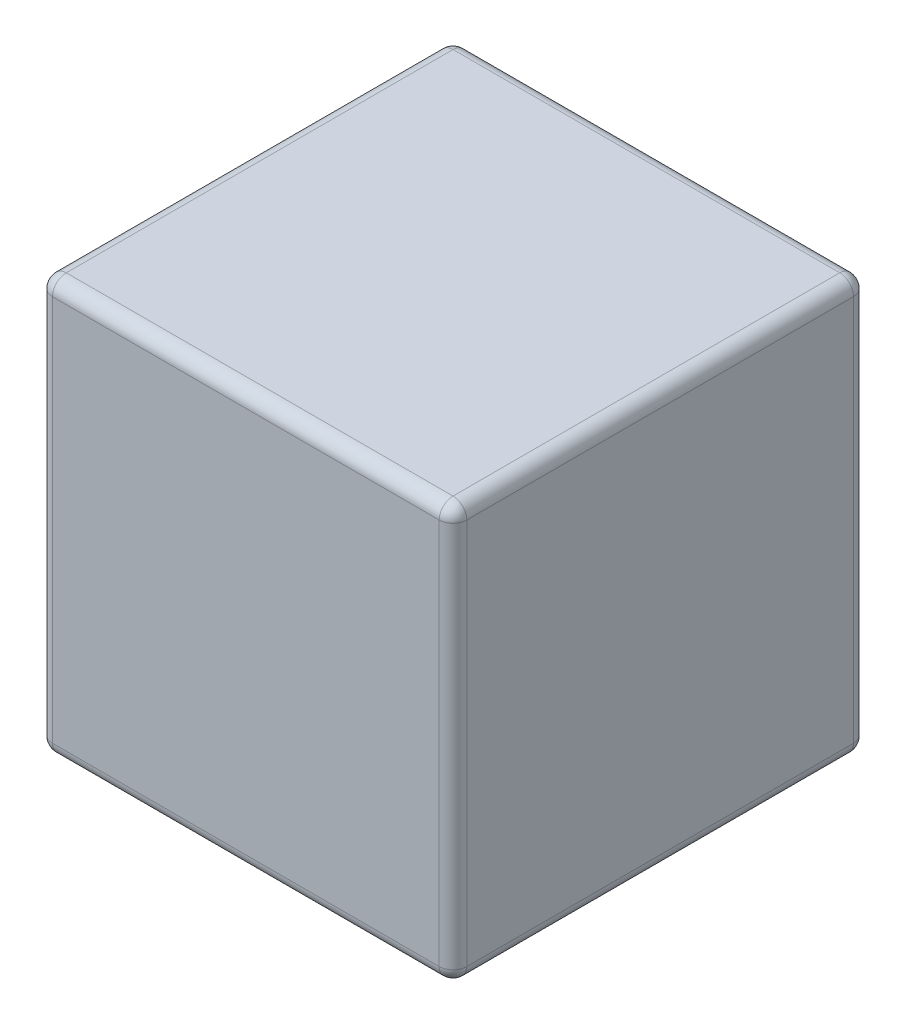
ISO-10303-21;
HEADER;
FILE_DESCRIPTION(('STEP AP214'),'2;1');
FILE_NAME('part.step','',(''),(''),'','','');
FILE_SCHEMA(('AUTOMOTIVE_DESIGN { 1 0 10303 214 1 1 1 1 }'));
ENDSEC;
DATA;
#1=APPLICATION_CONTEXT('core data for automotive mechanical design processes');
#2=APPLICATION_PROTOCOL_DEFINITION('international standard','automotive_design',2000,#1);
#3=PRODUCT_CONTEXT('',#1,'mechanical');
#4=PRODUCT('Part','Part','',(#3));
#5=PRODUCT_RELATED_PRODUCT_CATEGORY('part','',(#4));
#6=PRODUCT_DEFINITION_FORMATION('','',#4);
#7=PRODUCT_DEFINITION_CONTEXT('part definition',#1,'design');
#8=PRODUCT_DEFINITION('design','',#6,#7);
#9=PRODUCT_DEFINITION_SHAPE('','',#8);
#10=(LENGTH_UNIT() NAMED_UNIT(*) SI_UNIT(.MILLI.,.METRE.));
#11=(NAMED_UNIT(*) PLANE_ANGLE_UNIT() SI_UNIT($,.RADIAN.));
#12=(NAMED_UNIT(*) SI_UNIT($,.STERADIAN.) SOLID_ANGLE_UNIT());
#13=UNCERTAINTY_MEASURE_WITH_UNIT(LENGTH_MEASURE(1.E-05),#10,'distance_accuracy_value','');
#14=(GEOMETRIC_REPRESENTATION_CONTEXT(3) GLOBAL_UNCERTAINTY_ASSIGNED_CONTEXT((#13)) GLOBAL_UNIT_ASSIGNED_CONTEXT((#10,
#11,#12)) REPRESENTATION_CONTEXT('',''));
#15=CARTESIAN_POINT('',(0.,0.,0.));
#16=DIRECTION('',(0.,0.,1.));
#17=DIRECTION('',(1.,0.,0.));
#18=AXIS2_PLACEMENT_3D('',#15,#16,#17);
#19=CARTESIAN_POINT('',(1.5,0.,0.));
#20=DIRECTION('',(0.,1.,0.));
#21=DIRECTION('',(0.,0.,1.));
#22=AXIS2_PLACEMENT_3D('',#19,#20,#21);
#23=PLANE('',#22);
#24=DIRECTION('',(-1.,0.,0.));
#25=VECTOR('',#24,1.);
#26=CARTESIAN_POINT('',(1.5,0.,2.9));
#27=LINE('',#26,#25);
#28=CARTESIAN_POINT('',(1.4,0.,2.9));
#29=VERTEX_POINT('',#28);
#30=CARTESIAN_POINT('',(-1.4,0.,2.9));
#31=VERTEX_POINT('',#30);
#32=EDGE_CURVE('E138',#29,#31,#27,.T.);
#33=ORIENTED_EDGE('',*,*,#32,.T.);
#34=DIRECTION('',(0.,0.,-1.));
#35=VECTOR('',#34,1.);
#36=CARTESIAN_POINT('',(-1.4,0.,0.));
#37=LINE('',#36,#35);
#38=CARTESIAN_POINT('',(-1.4,0.,0.1));
#39=VERTEX_POINT('',#38);
#40=EDGE_CURVE('E134',#31,#39,#37,.T.);
#41=ORIENTED_EDGE('',*,*,#40,.T.);
#42=DIRECTION('',(-1.,0.,0.));
#43=VECTOR('',#42,1.);
#44=CARTESIAN_POINT('',(1.5,0.,0.1));
#45=LINE('',#44,#43);
#46=CARTESIAN_POINT('',(1.4,0.,0.1));
#47=VERTEX_POINT('',#46);
#48=EDGE_CURVE('E129',#39,#47,#45,.F.);
#49=ORIENTED_EDGE('',*,*,#48,.T.);
#50=DIRECTION('',(0.,0.,-1.));
#51=VECTOR('',#50,1.);
#52=CARTESIAN_POINT('',(1.4,0.,0.));
#53=LINE('',#52,#51);
#54=EDGE_CURVE('E131',#47,#29,#53,.F.);
#55=ORIENTED_EDGE('',*,*,#54,.T.);
#56=EDGE_LOOP('',(#33,#41,#49,#55));
#57=FACE_BOUND('',#56,.T.);
#58=ADVANCED_FACE('F41',(#57),#23,.F.);
#59=CARTESIAN_POINT('',(1.5,0.,0.));
#60=DIRECTION('',(0.,0.,1.));
#61=DIRECTION('',(1.,0.,0.));
#62=AXIS2_PLACEMENT_3D('',#59,#60,#61);
#63=PLANE('',#62);
#64=DIRECTION('',(0.,1.,0.));
#65=VECTOR('',#64,1.);
#66=CARTESIAN_POINT('',(1.4,0.,0.));
#67=LINE('',#66,#65);
#68=CARTESIAN_POINT('',(1.4,2.9,0.));
#69=VERTEX_POINT('',#68);
#70=CARTESIAN_POINT('',(1.4,0.1,0.));
#71=VERTEX_POINT('',#70);
#72=EDGE_CURVE('E284',#69,#71,#67,.F.);
#73=ORIENTED_EDGE('',*,*,#72,.T.);
#74=DIRECTION('',(-1.,0.,0.));
#75=VECTOR('',#74,1.);
#76=CARTESIAN_POINT('',(1.5,0.1,0.));
#77=LINE('',#76,#75);
#78=CARTESIAN_POINT('',(-1.4,0.1,0.));
#79=VERTEX_POINT('',#78);
#80=EDGE_CURVE('E160',#71,#79,#77,.T.);
#81=ORIENTED_EDGE('',*,*,#80,.T.);
#82=DIRECTION('',(0.,1.,0.));
#83=VECTOR('',#82,1.);
#84=CARTESIAN_POINT('',(-1.4,3.,0.));
#85=LINE('',#84,#83);
#86=CARTESIAN_POINT('',(-1.4,2.9,0.));
#87=VERTEX_POINT('',#86);
#88=EDGE_CURVE('E226',#79,#87,#85,.T.);
#89=ORIENTED_EDGE('',*,*,#88,.T.);
#90=DIRECTION('',(-1.,0.,0.));
#91=VECTOR('',#90,1.);
#92=CARTESIAN_POINT('',(1.5,2.9,0.));
#93=LINE('',#92,#91);
#94=EDGE_CURVE('E282',#87,#69,#93,.F.);
#95=ORIENTED_EDGE('',*,*,#94,.T.);
#96=EDGE_LOOP('',(#73,#81,#89,#95));
#97=FACE_BOUND('',#96,.T.);
#98=ADVANCED_FACE('F291',(#97),#63,.F.);
#99=CARTESIAN_POINT('',(1.5,3.,0.));
#100=DIRECTION('',(0.,-1.,0.));
#101=DIRECTION('',(0.,0.,-1.));
#102=AXIS2_PLACEMENT_3D('',#99,#100,#101);
#103=PLANE('',#102);
#104=DIRECTION('',(0.,0.,1.));
#105=VECTOR('',#104,1.);
#106=CARTESIAN_POINT('',(1.4,3.,0.));
#107=LINE('',#106,#105);
#108=CARTESIAN_POINT('',(1.4,3.,2.9));
#109=VERTEX_POINT('',#108);
#110=CARTESIAN_POINT('',(1.4,3.,0.1));
#111=VERTEX_POINT('',#110);
#112=EDGE_CURVE('E50',#109,#111,#107,.F.);
#113=ORIENTED_EDGE('',*,*,#112,.T.);
#114=DIRECTION('',(-1.,0.,0.));
#115=VECTOR('',#114,1.);
#116=CARTESIAN_POINT('',(1.5,3.,0.1));
#117=LINE('',#116,#115);
#118=CARTESIAN_POINT('',(-1.4,3.,0.1));
#119=VERTEX_POINT('',#118);
#120=EDGE_CURVE('E11',#111,#119,#117,.T.);
#121=ORIENTED_EDGE('',*,*,#120,.T.);
#122=DIRECTION('',(0.,0.,1.));
#123=VECTOR('',#122,1.);
#124=CARTESIAN_POINT('',(-1.4,3.,3.));
#125=LINE('',#124,#123);
#126=CARTESIAN_POINT('',(-1.4,3.,2.9));
#127=VERTEX_POINT('',#126);
#128=EDGE_CURVE('E243',#119,#127,#125,.T.);
#129=ORIENTED_EDGE('',*,*,#128,.T.);
#130=DIRECTION('',(-1.,0.,0.));
#131=VECTOR('',#130,1.);
#132=CARTESIAN_POINT('',(1.5,3.,2.9));
#133=LINE('',#132,#131);
#134=EDGE_CURVE('E61',#127,#109,#133,.F.);
#135=ORIENTED_EDGE('',*,*,#134,.T.);
#136=EDGE_LOOP('',(#113,#121,#129,#135));
#137=FACE_BOUND('',#136,.T.);
#138=ADVANCED_FACE('F323',(#137),#103,.F.);
#139=CARTESIAN_POINT('',(1.5,0.,3.));
#140=DIRECTION('',(0.,0.,-1.));
#141=DIRECTION('',(-1.,0.,0.));
#142=AXIS2_PLACEMENT_3D('',#139,#140,#141);
#143=PLANE('',#142);
#144=DIRECTION('',(0.,-1.,0.));
#145=VECTOR('',#144,1.);
#146=CARTESIAN_POINT('',(-1.4,0.,3.));
#147=LINE('',#146,#145);
#148=CARTESIAN_POINT('',(-1.4,2.9,3.));
#149=VERTEX_POINT('',#148);
#150=CARTESIAN_POINT('',(-1.4,0.0999999999999992,3.));
#151=VERTEX_POINT('',#150);
#152=EDGE_CURVE('E224',#149,#151,#147,.T.);
#153=ORIENTED_EDGE('',*,*,#152,.T.);
#154=DIRECTION('',(-1.,0.,0.));
#155=VECTOR('',#154,1.);
#156=CARTESIAN_POINT('',(1.5,0.0999999999999992,3.));
#157=LINE('',#156,#155);
#158=CARTESIAN_POINT('',(1.4,0.0999999999999992,3.));
#159=VERTEX_POINT('',#158);
#160=EDGE_CURVE('E231',#151,#159,#157,.F.);
#161=ORIENTED_EDGE('',*,*,#160,.T.);
#162=DIRECTION('',(0.,-1.,0.));
#163=VECTOR('',#162,1.);
#164=CARTESIAN_POINT('',(1.4,0.,3.));
#165=LINE('',#164,#163);
#166=CARTESIAN_POINT('',(1.4,2.9,3.));
#167=VERTEX_POINT('',#166);
#168=EDGE_CURVE('E222',#159,#167,#165,.F.);
#169=ORIENTED_EDGE('',*,*,#168,.T.);
#170=DIRECTION('',(-1.,0.,0.));
#171=VECTOR('',#170,1.);
#172=CARTESIAN_POINT('',(1.5,2.9,3.));
#173=LINE('',#172,#171);
#174=EDGE_CURVE('E219',#167,#149,#173,.T.);
#175=ORIENTED_EDGE('',*,*,#174,.T.);
#176=EDGE_LOOP('',(#153,#161,#169,#175));
#177=FACE_BOUND('',#176,.T.);
#178=ADVANCED_FACE('F313',(#177),#143,.F.);
#179=CARTESIAN_POINT('',(1.5,0.,0.));
#180=DIRECTION('',(-1.,0.,0.));
#181=DIRECTION('',(0.,0.,1.));
#182=AXIS2_PLACEMENT_3D('',#179,#180,#181);
#183=PLANE('',#182);
#184=DIRECTION('',(0.,-1.,0.));
#185=VECTOR('',#184,1.);
#186=CARTESIAN_POINT('',(1.5,0.,2.9));
#187=LINE('',#186,#185);
#188=CARTESIAN_POINT('',(1.5,2.9,2.9));
#189=VERTEX_POINT('',#188);
#190=CARTESIAN_POINT('',(1.5,0.0999999999999992,2.9));
#191=VERTEX_POINT('',#190);
#192=EDGE_CURVE('E238',#189,#191,#187,.T.);
#193=ORIENTED_EDGE('',*,*,#192,.T.);
#194=DIRECTION('',(0.,0.,-1.));
#195=VECTOR('',#194,1.);
#196=CARTESIAN_POINT('',(1.5,0.1,0.));
#197=LINE('',#196,#195);
#198=CARTESIAN_POINT('',(1.5,0.1,0.1));
#199=VERTEX_POINT('',#198);
#200=EDGE_CURVE('E241',#191,#199,#197,.T.);
#201=ORIENTED_EDGE('',*,*,#200,.T.);
#202=DIRECTION('',(0.,1.,0.));
#203=VECTOR('',#202,1.);
#204=CARTESIAN_POINT('',(1.5,0.,0.1));
#205=LINE('',#204,#203);
#206=CARTESIAN_POINT('',(1.5,2.9,0.1));
#207=VERTEX_POINT('',#206);
#208=EDGE_CURVE('E236',#199,#207,#205,.T.);
#209=ORIENTED_EDGE('',*,*,#208,.T.);
#210=DIRECTION('',(0.,0.,1.));
#211=VECTOR('',#210,1.);
#212=CARTESIAN_POINT('',(1.5,2.9,0.));
#213=LINE('',#212,#211);
#214=EDGE_CURVE('E234',#207,#189,#213,.T.);
#215=ORIENTED_EDGE('',*,*,#214,.T.);
#216=EDGE_LOOP('',(#193,#201,#209,#215));
#217=FACE_BOUND('',#216,.T.);
#218=ADVANCED_FACE('F319',(#217),#183,.F.);
#219=CARTESIAN_POINT('',(-1.5,0.,0.));
#220=DIRECTION('',(-1.,0.,0.));
#221=DIRECTION('',(0.,0.,1.));
#222=AXIS2_PLACEMENT_3D('',#219,#220,#221);
#223=PLANE('',#222);
#224=DIRECTION('',(0.,1.,0.));
#225=VECTOR('',#224,1.);
#226=CARTESIAN_POINT('',(-1.5,0.,0.1));
#227=LINE('',#226,#225);
#228=CARTESIAN_POINT('',(-1.5,2.9,0.1));
#229=VERTEX_POINT('',#228);
#230=CARTESIAN_POINT('',(-1.5,0.1,0.1));
#231=VERTEX_POINT('',#230);
#232=EDGE_CURVE('E272',#229,#231,#227,.F.);
#233=ORIENTED_EDGE('',*,*,#232,.T.);
#234=DIRECTION('',(0.,0.,-1.));
#235=VECTOR('',#234,1.);
#236=CARTESIAN_POINT('',(-1.5,0.0999999999999991,3.));
#237=LINE('',#236,#235);
#238=CARTESIAN_POINT('',(-1.5,0.0999999999999992,2.9));
#239=VERTEX_POINT('',#238);
#240=EDGE_CURVE('E276',#231,#239,#237,.F.);
#241=ORIENTED_EDGE('',*,*,#240,.T.);
#242=DIRECTION('',(0.,-1.,0.));
#243=VECTOR('',#242,1.);
#244=CARTESIAN_POINT('',(-1.5,3.,2.9));
#245=LINE('',#244,#243);
#246=CARTESIAN_POINT('',(-1.5,2.9,2.9));
#247=VERTEX_POINT('',#246);
#248=EDGE_CURVE('E267',#239,#247,#245,.F.);
#249=ORIENTED_EDGE('',*,*,#248,.T.);
#250=DIRECTION('',(0.,0.,1.));
#251=VECTOR('',#250,1.);
#252=CARTESIAN_POINT('',(-1.5,2.9,0.));
#253=LINE('',#252,#251);
#254=EDGE_CURVE('E273',#247,#229,#253,.F.);
#255=ORIENTED_EDGE('',*,*,#254,.T.);
#256=EDGE_LOOP('',(#233,#241,#249,#255));
#257=FACE_BOUND('',#256,.T.);
#258=ADVANCED_FACE('F277',(#257),#223,.T.);
#259=CARTESIAN_POINT('',(1.4,2.9,0.));
#260=DIRECTION('',(0.,0.,1.));
#261=DIRECTION('',(0.,-1.,0.));
#262=AXIS2_PLACEMENT_3D('',#259,#260,#261);
#263=CYLINDRICAL_SURFACE('',#262,0.1);
#264=CARTESIAN_POINT('',(1.4,2.9,2.9));
#265=DIRECTION('',(0.,0.,1.));
#266=DIRECTION('',(1.,0.,0.));
#267=AXIS2_PLACEMENT_3D('',#264,#265,#266);
#268=CIRCLE('',#267,0.1);
#269=EDGE_CURVE('E45',#189,#109,#268,.T.);
#270=ORIENTED_EDGE('',*,*,#269,.F.);
#271=ORIENTED_EDGE('',*,*,#214,.F.);
#272=CARTESIAN_POINT('',(1.4,2.9,0.1));
#273=DIRECTION('',(0.,0.,-1.));
#274=DIRECTION('',(0.,1.,0.));
#275=AXIS2_PLACEMENT_3D('',#272,#273,#274);
#276=CIRCLE('',#275,0.1);
#277=EDGE_CURVE('E200',#111,#207,#276,.T.);
#278=ORIENTED_EDGE('',*,*,#277,.F.);
#279=ORIENTED_EDGE('',*,*,#112,.F.);
#280=EDGE_LOOP('',(#270,#271,#278,#279));
#281=FACE_BOUND('',#280,.T.);
#282=ADVANCED_FACE('F43',(#281),#263,.T.);
#283=CARTESIAN_POINT('',(1.4,2.9,2.9));
#284=DIRECTION('',(0.,1.,0.));
#285=DIRECTION('',(0.,0.,1.));
#286=AXIS2_PLACEMENT_3D('',#283,#284,#285);
#287=SPHERICAL_SURFACE('',#286,0.1);
#288=CARTESIAN_POINT('',(1.4,2.9,2.9));
#289=DIRECTION('',(0.,1.,0.));
#290=DIRECTION('',(0.,0.,1.));
#291=AXIS2_PLACEMENT_3D('',#288,#289,#290);
#292=CIRCLE('',#291,0.1);
#293=EDGE_CURVE('E195',#189,#167,#292,.F.);
#294=ORIENTED_EDGE('',*,*,#293,.F.);
#295=ORIENTED_EDGE('',*,*,#269,.T.);
#296=CARTESIAN_POINT('',(1.4,2.9,2.9));
#297=DIRECTION('',(1.,0.,0.));
#298=DIRECTION('',(0.,0.,-1.));
#299=AXIS2_PLACEMENT_3D('',#296,#297,#298);
#300=CIRCLE('',#299,0.1);
#301=EDGE_CURVE('E198',#167,#109,#300,.F.);
#302=ORIENTED_EDGE('',*,*,#301,.F.);
#303=EDGE_LOOP('',(#294,#295,#302));
#304=FACE_BOUND('',#303,.T.);
#305=ADVANCED_FACE('F210',(#304),#287,.T.);
#306=CARTESIAN_POINT('',(1.4,2.9,0.1));
#307=DIRECTION('',(1.,0.,0.));
#308=DIRECTION('',(0.,0.,-1.));
#309=AXIS2_PLACEMENT_3D('',#306,#307,#308);
#310=SPHERICAL_SURFACE('',#309,0.1);
#311=CARTESIAN_POINT('',(1.4,2.9,0.1));
#312=DIRECTION('',(1.,0.,0.));
#313=DIRECTION('',(0.,0.,-1.));
#314=AXIS2_PLACEMENT_3D('',#311,#312,#313);
#315=CIRCLE('',#314,0.1);
#316=EDGE_CURVE('E189',#111,#69,#315,.F.);
#317=ORIENTED_EDGE('',*,*,#316,.F.);
#318=ORIENTED_EDGE('',*,*,#277,.T.);
#319=CARTESIAN_POINT('',(1.4,2.9,0.1));
#320=DIRECTION('',(0.,1.,0.));
#321=DIRECTION('',(0.,0.,1.));
#322=AXIS2_PLACEMENT_3D('',#319,#320,#321);
#323=CIRCLE('',#322,0.1);
#324=EDGE_CURVE('E192',#69,#207,#323,.F.);
#325=ORIENTED_EDGE('',*,*,#324,.F.);
#326=EDGE_LOOP('',(#317,#318,#325));
#327=FACE_BOUND('',#326,.T.);
#328=ADVANCED_FACE('F321',(#327),#310,.T.);
#329=CARTESIAN_POINT('',(1.5,2.9,2.9));
#330=DIRECTION('',(-1.,0.,0.));
#331=DIRECTION('',(0.,0.,1.));
#332=AXIS2_PLACEMENT_3D('',#329,#330,#331);
#333=CYLINDRICAL_SURFACE('',#332,0.1);
#334=ORIENTED_EDGE('',*,*,#301,.T.);
#335=ORIENTED_EDGE('',*,*,#134,.F.);
#336=CARTESIAN_POINT('',(-1.4,2.9,2.9));
#337=DIRECTION('',(-1.,0.,0.));
#338=DIRECTION('',(0.,0.,1.));
#339=AXIS2_PLACEMENT_3D('',#336,#337,#338);
#340=CIRCLE('',#339,0.1);
#341=EDGE_CURVE('E183',#149,#127,#340,.T.);
#342=ORIENTED_EDGE('',*,*,#341,.F.);
#343=ORIENTED_EDGE('',*,*,#174,.F.);
#344=EDGE_LOOP('',(#334,#335,#342,#343));
#345=FACE_BOUND('',#344,.T.);
#346=ADVANCED_FACE('F216',(#345),#333,.T.);
#347=CARTESIAN_POINT('',(1.4,0.,2.9));
#348=DIRECTION('',(0.,-1.,0.));
#349=DIRECTION('',(0.,0.,-1.));
#350=AXIS2_PLACEMENT_3D('',#347,#348,#349);
#351=CYLINDRICAL_SURFACE('',#350,0.1);
#352=ORIENTED_EDGE('',*,*,#293,.T.);
#353=ORIENTED_EDGE('',*,*,#168,.F.);
#354=CARTESIAN_POINT('',(1.4,0.0999999999999992,2.9));
#355=DIRECTION('',(0.,-1.,0.));
#356=DIRECTION('',(0.,0.,-1.));
#357=AXIS2_PLACEMENT_3D('',#354,#355,#356);
#358=CIRCLE('',#357,0.1);
#359=EDGE_CURVE('E180',#191,#159,#358,.T.);
#360=ORIENTED_EDGE('',*,*,#359,.F.);
#361=ORIENTED_EDGE('',*,*,#192,.F.);
#362=EDGE_LOOP('',(#352,#353,#360,#361));
#363=FACE_BOUND('',#362,.T.);
#364=ADVANCED_FACE('F317',(#363),#351,.T.);
#365=CARTESIAN_POINT('',(1.4,0.1,0.));
#366=DIRECTION('',(0.,0.,-1.));
#367=DIRECTION('',(0.,1.,0.));
#368=AXIS2_PLACEMENT_3D('',#365,#366,#367);
#369=CYLINDRICAL_SURFACE('',#368,0.1);
#370=CARTESIAN_POINT('',(1.4,0.1,0.1));
#371=DIRECTION('',(0.,0.,-1.));
#372=DIRECTION('',(0.,1.,0.));
#373=AXIS2_PLACEMENT_3D('',#370,#371,#372);
#374=CIRCLE('',#373,0.1);
#375=EDGE_CURVE('E145',#199,#47,#374,.T.);
#376=ORIENTED_EDGE('',*,*,#375,.F.);
#377=ORIENTED_EDGE('',*,*,#200,.F.);
#378=CARTESIAN_POINT('',(1.4,0.0999999999999992,2.9));
#379=DIRECTION('',(0.,0.,1.));
#380=DIRECTION('',(1.,0.,0.));
#381=AXIS2_PLACEMENT_3D('',#378,#379,#380);
#382=CIRCLE('',#381,0.1);
#383=EDGE_CURVE('E147',#29,#191,#382,.T.);
#384=ORIENTED_EDGE('',*,*,#383,.F.);
#385=ORIENTED_EDGE('',*,*,#54,.F.);
#386=EDGE_LOOP('',(#376,#377,#384,#385));
#387=FACE_BOUND('',#386,.T.);
#388=ADVANCED_FACE('F143',(#387),#369,.T.);
#389=CARTESIAN_POINT('',(1.4,0.,0.1));
#390=DIRECTION('',(0.,1.,0.));
#391=DIRECTION('',(0.,0.,1.));
#392=AXIS2_PLACEMENT_3D('',#389,#390,#391);
#393=CYLINDRICAL_SURFACE('',#392,0.1);
#394=ORIENTED_EDGE('',*,*,#324,.T.);
#395=ORIENTED_EDGE('',*,*,#208,.F.);
#396=CARTESIAN_POINT('',(1.4,0.1,0.1));
#397=DIRECTION('',(0.,-1.,0.));
#398=DIRECTION('',(0.,0.,-1.));
#399=AXIS2_PLACEMENT_3D('',#396,#397,#398);
#400=CIRCLE('',#399,0.1);
#401=EDGE_CURVE('E156',#71,#199,#400,.T.);
#402=ORIENTED_EDGE('',*,*,#401,.F.);
#403=ORIENTED_EDGE('',*,*,#72,.F.);
#404=EDGE_LOOP('',(#394,#395,#402,#403));
#405=FACE_BOUND('',#404,.T.);
#406=ADVANCED_FACE('F437',(#405),#393,.T.);
#407=CARTESIAN_POINT('',(1.5,2.9,0.1));
#408=DIRECTION('',(-1.,0.,0.));
#409=DIRECTION('',(0.,0.,1.));
#410=AXIS2_PLACEMENT_3D('',#407,#408,#409);
#411=CYLINDRICAL_SURFACE('',#410,0.1);
#412=ORIENTED_EDGE('',*,*,#316,.T.);
#413=ORIENTED_EDGE('',*,*,#94,.F.);
#414=CARTESIAN_POINT('',(-1.4,2.9,0.1));
#415=DIRECTION('',(-1.,0.,0.));
#416=DIRECTION('',(0.,0.,1.));
#417=AXIS2_PLACEMENT_3D('',#414,#415,#416);
#418=CIRCLE('',#417,0.1);
#419=EDGE_CURVE('E175',#119,#87,#418,.T.);
#420=ORIENTED_EDGE('',*,*,#419,.F.);
#421=ORIENTED_EDGE('',*,*,#120,.F.);
#422=EDGE_LOOP('',(#412,#413,#420,#421));
#423=FACE_BOUND('',#422,.T.);
#424=ADVANCED_FACE('F295',(#423),#411,.T.);
#425=CARTESIAN_POINT('',(-1.4,2.9,0.));
#426=DIRECTION('',(0.,0.,-1.));
#427=DIRECTION('',(0.,1.,0.));
#428=AXIS2_PLACEMENT_3D('',#425,#426,#427);
#429=CYLINDRICAL_SURFACE('',#428,0.1);
#430=CARTESIAN_POINT('',(-1.4,2.9,2.9));
#431=DIRECTION('',(0.,0.,1.));
#432=DIRECTION('',(1.,0.,0.));
#433=AXIS2_PLACEMENT_3D('',#430,#431,#432);
#434=CIRCLE('',#433,0.1);
#435=EDGE_CURVE('E186',#127,#247,#434,.T.);
#436=ORIENTED_EDGE('',*,*,#435,.F.);
#437=ORIENTED_EDGE('',*,*,#128,.F.);
#438=CARTESIAN_POINT('',(-1.4,2.9,0.1));
#439=DIRECTION('',(0.,0.,-1.));
#440=DIRECTION('',(0.,1.,0.));
#441=AXIS2_PLACEMENT_3D('',#438,#439,#440);
#442=CIRCLE('',#441,0.1);
#443=EDGE_CURVE('E173',#229,#119,#442,.T.);
#444=ORIENTED_EDGE('',*,*,#443,.F.);
#445=ORIENTED_EDGE('',*,*,#254,.F.);
#446=EDGE_LOOP('',(#436,#437,#444,#445));
#447=FACE_BOUND('',#446,.T.);
#448=ADVANCED_FACE('F325',(#447),#429,.T.);
#449=CARTESIAN_POINT('',(-1.4,2.9,2.9));
#450=DIRECTION('',(0.,1.,0.));
#451=DIRECTION('',(-1.,0.,0.));
#452=AXIS2_PLACEMENT_3D('',#449,#450,#451);
#453=SPHERICAL_SURFACE('',#452,0.1);
#454=ORIENTED_EDGE('',*,*,#341,.T.);
#455=ORIENTED_EDGE('',*,*,#435,.T.);
#456=CARTESIAN_POINT('',(-1.4,2.9,2.9));
#457=DIRECTION('',(0.,1.,0.));
#458=DIRECTION('',(0.,0.,1.));
#459=AXIS2_PLACEMENT_3D('',#456,#457,#458);
#460=CIRCLE('',#459,0.1);
#461=EDGE_CURVE('E164',#149,#247,#460,.F.);
#462=ORIENTED_EDGE('',*,*,#461,.F.);
#463=EDGE_LOOP('',(#454,#455,#462));
#464=FACE_BOUND('',#463,.T.);
#465=ADVANCED_FACE('F327',(#464),#453,.T.);
#466=CARTESIAN_POINT('',(1.4,0.0999999999999992,2.9));
#467=DIRECTION('',(1.,0.,0.));
#468=DIRECTION('',(0.,0.,-1.));
#469=AXIS2_PLACEMENT_3D('',#466,#467,#468);
#470=SPHERICAL_SURFACE('',#469,0.1);
#471=ORIENTED_EDGE('',*,*,#383,.T.);
#472=ORIENTED_EDGE('',*,*,#359,.T.);
#473=CARTESIAN_POINT('',(1.4,0.0999999999999992,2.9));
#474=DIRECTION('',(1.,0.,0.));
#475=DIRECTION('',(0.,0.,-1.));
#476=AXIS2_PLACEMENT_3D('',#473,#474,#475);
#477=CIRCLE('',#476,0.1);
#478=EDGE_CURVE('E161',#29,#159,#477,.F.);
#479=ORIENTED_EDGE('',*,*,#478,.F.);
#480=EDGE_LOOP('',(#471,#472,#479));
#481=FACE_BOUND('',#480,.T.);
#482=ADVANCED_FACE('F329',(#481),#470,.T.);
#483=CARTESIAN_POINT('',(1.4,0.1,0.1));
#484=DIRECTION('',(1.,0.,0.));
#485=DIRECTION('',(0.,0.,-1.));
#486=AXIS2_PLACEMENT_3D('',#483,#484,#485);
#487=SPHERICAL_SURFACE('',#486,0.1);
#488=ORIENTED_EDGE('',*,*,#401,.T.);
#489=ORIENTED_EDGE('',*,*,#375,.T.);
#490=CARTESIAN_POINT('',(1.4,0.1,0.1));
#491=DIRECTION('',(1.,0.,0.));
#492=DIRECTION('',(0.,0.,-1.));
#493=AXIS2_PLACEMENT_3D('',#490,#491,#492);
#494=CIRCLE('',#493,0.1);
#495=EDGE_CURVE('E153',#71,#47,#494,.F.);
#496=ORIENTED_EDGE('',*,*,#495,.F.);
#497=EDGE_LOOP('',(#488,#489,#496));
#498=FACE_BOUND('',#497,.T.);
#499=ADVANCED_FACE('F152',(#498),#487,.T.);
#500=CARTESIAN_POINT('',(-1.4,2.9,0.1));
#501=DIRECTION('',(0.,1.,0.));
#502=DIRECTION('',(-1.,0.,0.));
#503=AXIS2_PLACEMENT_3D('',#500,#501,#502);
#504=SPHERICAL_SURFACE('',#503,0.1);
#505=ORIENTED_EDGE('',*,*,#443,.T.);
#506=ORIENTED_EDGE('',*,*,#419,.T.);
#507=CARTESIAN_POINT('',(-1.4,2.9,0.1));
#508=DIRECTION('',(0.,1.,0.));
#509=DIRECTION('',(0.,0.,1.));
#510=AXIS2_PLACEMENT_3D('',#507,#508,#509);
#511=CIRCLE('',#510,0.1);
#512=EDGE_CURVE('E162',#229,#87,#511,.F.);
#513=ORIENTED_EDGE('',*,*,#512,.F.);
#514=EDGE_LOOP('',(#505,#506,#513));
#515=FACE_BOUND('',#514,.T.);
#516=ADVANCED_FACE('F300',(#515),#504,.T.);
#517=CARTESIAN_POINT('',(-1.4,0.,2.9));
#518=DIRECTION('',(0.,1.,0.));
#519=DIRECTION('',(0.,0.,1.));
#520=AXIS2_PLACEMENT_3D('',#517,#518,#519);
#521=CYLINDRICAL_SURFACE('',#520,0.1);
#522=ORIENTED_EDGE('',*,*,#461,.T.);
#523=ORIENTED_EDGE('',*,*,#248,.F.);
#524=CARTESIAN_POINT('',(-1.4,0.0999999999999992,2.9));
#525=DIRECTION('',(0.,-1.,0.));
#526=DIRECTION('',(0.,0.,-1.));
#527=AXIS2_PLACEMENT_3D('',#524,#525,#526);
#528=CIRCLE('',#527,0.1);
#529=EDGE_CURVE('E167',#151,#239,#528,.T.);
#530=ORIENTED_EDGE('',*,*,#529,.F.);
#531=ORIENTED_EDGE('',*,*,#152,.F.);
#532=EDGE_LOOP('',(#522,#523,#530,#531));
#533=FACE_BOUND('',#532,.T.);
#534=ADVANCED_FACE('F269',(#533),#521,.T.);
#535=CARTESIAN_POINT('',(1.5,0.0999999999999992,2.9));
#536=DIRECTION('',(-1.,0.,0.));
#537=DIRECTION('',(0.,0.,1.));
#538=AXIS2_PLACEMENT_3D('',#535,#536,#537);
#539=CYLINDRICAL_SURFACE('',#538,0.1);
#540=ORIENTED_EDGE('',*,*,#478,.T.);
#541=ORIENTED_EDGE('',*,*,#160,.F.);
#542=CARTESIAN_POINT('',(-1.4,0.0999999999999992,2.9));
#543=DIRECTION('',(-1.,0.,0.));
#544=DIRECTION('',(0.,0.,1.));
#545=AXIS2_PLACEMENT_3D('',#542,#543,#544);
#546=CIRCLE('',#545,0.1);
#547=EDGE_CURVE('E256',#31,#151,#546,.T.);
#548=ORIENTED_EDGE('',*,*,#547,.F.);
#549=ORIENTED_EDGE('',*,*,#32,.F.);
#550=EDGE_LOOP('',(#540,#541,#548,#549));
#551=FACE_BOUND('',#550,.T.);
#552=ADVANCED_FACE('F312',(#551),#539,.T.);
#553=CARTESIAN_POINT('',(1.5,0.1,0.1));
#554=DIRECTION('',(-1.,0.,0.));
#555=DIRECTION('',(0.,0.,1.));
#556=AXIS2_PLACEMENT_3D('',#553,#554,#555);
#557=CYLINDRICAL_SURFACE('',#556,0.1);
#558=ORIENTED_EDGE('',*,*,#495,.T.);
#559=ORIENTED_EDGE('',*,*,#48,.F.);
#560=CARTESIAN_POINT('',(-1.4,0.1,0.1));
#561=DIRECTION('',(-1.,0.,0.));
#562=DIRECTION('',(0.,0.,1.));
#563=AXIS2_PLACEMENT_3D('',#560,#561,#562);
#564=CIRCLE('',#563,0.1);
#565=EDGE_CURVE('E253',#79,#39,#564,.T.);
#566=ORIENTED_EDGE('',*,*,#565,.F.);
#567=ORIENTED_EDGE('',*,*,#80,.F.);
#568=EDGE_LOOP('',(#558,#559,#566,#567));
#569=FACE_BOUND('',#568,.T.);
#570=ADVANCED_FACE('F158',(#569),#557,.T.);
#571=CARTESIAN_POINT('',(-1.4,0.,0.1));
#572=DIRECTION('',(0.,-1.,0.));
#573=DIRECTION('',(0.,0.,-1.));
#574=AXIS2_PLACEMENT_3D('',#571,#572,#573);
#575=CYLINDRICAL_SURFACE('',#574,0.1);
#576=ORIENTED_EDGE('',*,*,#512,.T.);
#577=ORIENTED_EDGE('',*,*,#88,.F.);
#578=CARTESIAN_POINT('',(-1.4,0.1,0.1));
#579=DIRECTION('',(0.,-1.,0.));
#580=DIRECTION('',(0.,0.,-1.));
#581=AXIS2_PLACEMENT_3D('',#578,#579,#580);
#582=CIRCLE('',#581,0.1);
#583=EDGE_CURVE('E251',#231,#79,#582,.T.);
#584=ORIENTED_EDGE('',*,*,#583,.F.);
#585=ORIENTED_EDGE('',*,*,#232,.F.);
#586=EDGE_LOOP('',(#576,#577,#584,#585));
#587=FACE_BOUND('',#586,.T.);
#588=ADVANCED_FACE('F302',(#587),#575,.T.);
#589=CARTESIAN_POINT('',(-1.4,0.0999999999999992,2.9));
#590=DIRECTION('',(0.,0.,1.));
#591=DIRECTION('',(1.,0.,0.));
#592=AXIS2_PLACEMENT_3D('',#589,#590,#591);
#593=SPHERICAL_SURFACE('',#592,0.1);
#594=ORIENTED_EDGE('',*,*,#547,.T.);
#595=ORIENTED_EDGE('',*,*,#529,.T.);
#596=CARTESIAN_POINT('',(-1.4,0.0999999999999992,2.9));
#597=DIRECTION('',(0.,0.,1.));
#598=DIRECTION('',(1.,0.,0.));
#599=AXIS2_PLACEMENT_3D('',#596,#597,#598);
#600=CIRCLE('',#599,0.1);
#601=EDGE_CURVE('E249',#31,#239,#600,.F.);
#602=ORIENTED_EDGE('',*,*,#601,.F.);
#603=EDGE_LOOP('',(#594,#595,#602));
#604=FACE_BOUND('',#603,.T.);
#605=ADVANCED_FACE('F263',(#604),#593,.T.);
#606=CARTESIAN_POINT('',(-1.4,0.1,0.1));
#607=DIRECTION('',(0.,0.,-1.));
#608=DIRECTION('',(-1.,0.,0.));
#609=AXIS2_PLACEMENT_3D('',#606,#607,#608);
#610=SPHERICAL_SURFACE('',#609,0.1);
#611=ORIENTED_EDGE('',*,*,#583,.T.);
#612=ORIENTED_EDGE('',*,*,#565,.T.);
#613=CARTESIAN_POINT('',(-1.4,0.1,0.1));
#614=DIRECTION('',(0.,0.,-1.));
#615=DIRECTION('',(0.,1.,0.));
#616=AXIS2_PLACEMENT_3D('',#613,#614,#615);
#617=CIRCLE('',#616,0.1);
#618=EDGE_CURVE('E247',#231,#39,#617,.F.);
#619=ORIENTED_EDGE('',*,*,#618,.F.);
#620=EDGE_LOOP('',(#611,#612,#619));
#621=FACE_BOUND('',#620,.T.);
#622=ADVANCED_FACE('F304',(#621),#610,.T.);
#623=CARTESIAN_POINT('',(-1.4,0.1,0.));
#624=DIRECTION('',(0.,0.,1.));
#625=DIRECTION('',(0.,-1.,0.));
#626=AXIS2_PLACEMENT_3D('',#623,#624,#625);
#627=CYLINDRICAL_SURFACE('',#626,0.1);
#628=ORIENTED_EDGE('',*,*,#601,.T.);
#629=ORIENTED_EDGE('',*,*,#240,.F.);
#630=ORIENTED_EDGE('',*,*,#618,.T.);
#631=ORIENTED_EDGE('',*,*,#40,.F.);
#632=EDGE_LOOP('',(#628,#629,#630,#631));
#633=FACE_BOUND('',#632,.T.);
#634=ADVANCED_FACE('F305',(#633),#627,.T.);
#635=CLOSED_SHELL('',(#58,#98,#138,#178,#218,#258,#282,#305,#328,#346,#364,#388,#406,#424,#448,
#465,#482,#499,#516,#534,#552,#570,#588,#605,#622,#634));
#636=MANIFOLD_SOLID_BREP('B2',#635);
#637=ADVANCED_BREP_SHAPE_REPRESENTATION('',(#18,#636),#14);
#638=SHAPE_DEFINITION_REPRESENTATION(#9,#637);
ENDSEC;
END-ISO-10303-21;
